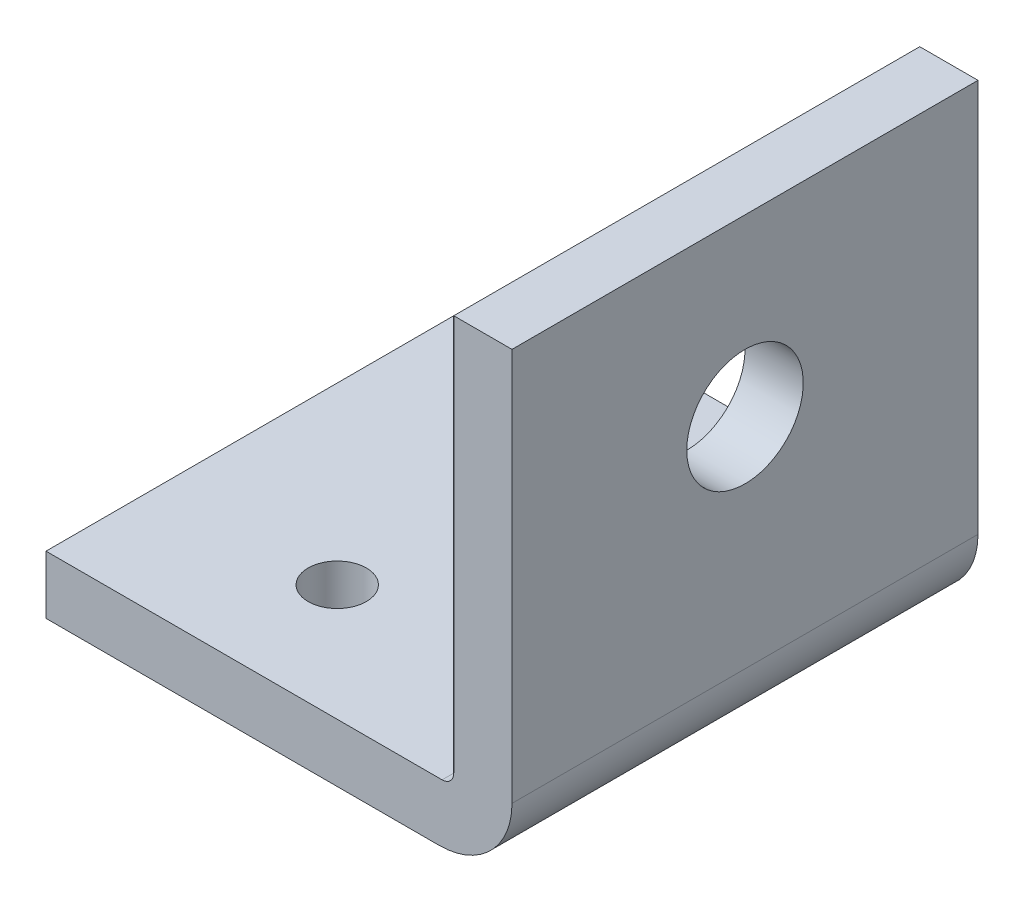
ISO-10303-21;
HEADER;
FILE_DESCRIPTION(('STEP AP214'),'2;1');
FILE_NAME('part.step','',(''),(''),'','','');
FILE_SCHEMA(('AUTOMOTIVE_DESIGN { 1 0 10303 214 1 1 1 1 }'));
ENDSEC;
DATA;
#1=APPLICATION_CONTEXT('core data for automotive mechanical design processes');
#2=APPLICATION_PROTOCOL_DEFINITION('international standard','automotive_design',2000,#1);
#3=PRODUCT_CONTEXT('',#1,'mechanical');
#4=PRODUCT('Part','Part','',(#3));
#5=PRODUCT_RELATED_PRODUCT_CATEGORY('part','',(#4));
#6=PRODUCT_DEFINITION_FORMATION('','',#4);
#7=PRODUCT_DEFINITION_CONTEXT('part definition',#1,'design');
#8=PRODUCT_DEFINITION('design','',#6,#7);
#9=PRODUCT_DEFINITION_SHAPE('','',#8);
#10=(LENGTH_UNIT() NAMED_UNIT(*) SI_UNIT(.MILLI.,.METRE.));
#11=(NAMED_UNIT(*) PLANE_ANGLE_UNIT() SI_UNIT($,.RADIAN.));
#12=(NAMED_UNIT(*) SI_UNIT($,.STERADIAN.) SOLID_ANGLE_UNIT());
#13=UNCERTAINTY_MEASURE_WITH_UNIT(LENGTH_MEASURE(1.E-05),#10,'distance_accuracy_value','');
#14=(GEOMETRIC_REPRESENTATION_CONTEXT(3) GLOBAL_UNCERTAINTY_ASSIGNED_CONTEXT((#13)) GLOBAL_UNIT_ASSIGNED_CONTEXT((#10,
#11,#12)) REPRESENTATION_CONTEXT('',''));
#15=CARTESIAN_POINT('',(0.,0.,0.));
#16=DIRECTION('',(0.,0.,1.));
#17=DIRECTION('',(1.,0.,0.));
#18=AXIS2_PLACEMENT_3D('',#15,#16,#17);
#19=CARTESIAN_POINT('',(33.75,0.,40.));
#20=DIRECTION('',(0.,1.,0.));
#21=DIRECTION('',(-1.,0.,0.));
#22=AXIS2_PLACEMENT_3D('',#19,#20,#21);
#23=PLANE('',#22);
#24=CARTESIAN_POINT('',(15.,0.,10.));
#25=DIRECTION('',(0.,1.,0.));
#26=DIRECTION('',(-1.,0.,0.));
#27=AXIS2_PLACEMENT_3D('',#24,#25,#26);
#28=CIRCLE('',#27,2.5);
#29=CARTESIAN_POINT('',(12.5,0.,10.));
#30=VERTEX_POINT('',#29);
#31=EDGE_CURVE('E156',#30,#30,#28,.T.);
#32=ORIENTED_EDGE('',*,*,#31,.T.);
#33=EDGE_LOOP('',(#32));
#34=FACE_BOUND('',#33,.T.);
#35=CARTESIAN_POINT('',(15.,0.,30.));
#36=DIRECTION('',(0.,1.,0.));
#37=DIRECTION('',(-1.,0.,0.));
#38=AXIS2_PLACEMENT_3D('',#35,#36,#37);
#39=CIRCLE('',#38,2.5);
#40=CARTESIAN_POINT('',(12.5,0.,30.));
#41=VERTEX_POINT('',#40);
#42=EDGE_CURVE('E165',#41,#41,#39,.T.);
#43=ORIENTED_EDGE('',*,*,#42,.T.);
#44=EDGE_LOOP('',(#43));
#45=FACE_BOUND('',#44,.T.);
#46=DIRECTION('',(1.,0.,0.));
#47=VECTOR('',#46,1.);
#48=CARTESIAN_POINT('',(33.75,0.,0.));
#49=LINE('',#48,#47);
#50=CARTESIAN_POINT('',(0.,0.,0.));
#51=VERTEX_POINT('',#50);
#52=CARTESIAN_POINT('',(33.75,0.,0.));
#53=VERTEX_POINT('',#52);
#54=EDGE_CURVE('E125',#51,#53,#49,.T.);
#55=ORIENTED_EDGE('',*,*,#54,.T.);
#56=DIRECTION('',(0.,0.,-1.));
#57=VECTOR('',#56,1.);
#58=CARTESIAN_POINT('',(33.75,0.,40.));
#59=LINE('',#58,#57);
#60=CARTESIAN_POINT('',(33.75,0.,40.));
#61=VERTEX_POINT('',#60);
#62=EDGE_CURVE('E106',#61,#53,#59,.T.);
#63=ORIENTED_EDGE('',*,*,#62,.F.);
#64=DIRECTION('',(1.,0.,0.));
#65=VECTOR('',#64,1.);
#66=CARTESIAN_POINT('',(33.75,0.,40.));
#67=LINE('',#66,#65);
#68=CARTESIAN_POINT('',(0.,0.,40.));
#69=VERTEX_POINT('',#68);
#70=EDGE_CURVE('E113',#69,#61,#67,.T.);
#71=ORIENTED_EDGE('',*,*,#70,.F.);
#72=DIRECTION('',(0.,0.,-1.));
#73=VECTOR('',#72,1.);
#74=CARTESIAN_POINT('',(0.,0.,40.));
#75=LINE('',#74,#73);
#76=EDGE_CURVE('E142',#69,#51,#75,.T.);
#77=ORIENTED_EDGE('',*,*,#76,.T.);
#78=EDGE_LOOP('',(#55,#63,#71,#77));
#79=FACE_BOUND('',#78,.T.);
#80=ADVANCED_FACE('F37',(#34,#45,#79),#23,.F.);
#81=CARTESIAN_POINT('',(33.75,6.25,40.));
#82=DIRECTION('',(0.,0.,-1.));
#83=DIRECTION('',(-1.,0.,0.));
#84=AXIS2_PLACEMENT_3D('',#81,#82,#83);
#85=CYLINDRICAL_SURFACE('',#84,6.25);
#86=CARTESIAN_POINT('',(33.75,6.25,0.));
#87=DIRECTION('',(0.,0.,1.));
#88=DIRECTION('',(-1.,0.,0.));
#89=AXIS2_PLACEMENT_3D('',#86,#87,#88);
#90=CIRCLE('',#89,6.25);
#91=CARTESIAN_POINT('',(40.,6.25000000000005,0.));
#92=VERTEX_POINT('',#91);
#93=EDGE_CURVE('E153',#53,#92,#90,.T.);
#94=ORIENTED_EDGE('',*,*,#93,.T.);
#95=DIRECTION('',(0.,0.,-1.));
#96=VECTOR('',#95,1.);
#97=CARTESIAN_POINT('',(40.,6.25000000000005,40.));
#98=LINE('',#97,#96);
#99=CARTESIAN_POINT('',(40.,6.25000000000005,40.));
#100=VERTEX_POINT('',#99);
#101=EDGE_CURVE('E109',#100,#92,#98,.T.);
#102=ORIENTED_EDGE('',*,*,#101,.F.);
#103=CARTESIAN_POINT('',(33.75,6.25,40.));
#104=DIRECTION('',(0.,0.,1.));
#105=DIRECTION('',(-1.,0.,0.));
#106=AXIS2_PLACEMENT_3D('',#103,#104,#105);
#107=CIRCLE('',#106,6.25);
#108=EDGE_CURVE('E102',#61,#100,#107,.T.);
#109=ORIENTED_EDGE('',*,*,#108,.F.);
#110=ORIENTED_EDGE('',*,*,#62,.T.);
#111=EDGE_LOOP('',(#94,#102,#109,#110));
#112=FACE_BOUND('',#111,.T.);
#113=ADVANCED_FACE('F104',(#112),#85,.T.);
#114=CARTESIAN_POINT('',(40.,40.,40.));
#115=DIRECTION('',(-1.,0.,0.));
#116=DIRECTION('',(0.,-1.,0.));
#117=AXIS2_PLACEMENT_3D('',#114,#115,#116);
#118=PLANE('',#117);
#119=CARTESIAN_POINT('',(40.,25.,20.));
#120=DIRECTION('',(-1.,0.,0.));
#121=DIRECTION('',(0.,0.,1.));
#122=AXIS2_PLACEMENT_3D('',#119,#120,#121);
#123=CIRCLE('',#122,5.);
#124=CARTESIAN_POINT('',(40.,25.,25.));
#125=VERTEX_POINT('',#124);
#126=EDGE_CURVE('E169',#125,#125,#123,.T.);
#127=ORIENTED_EDGE('',*,*,#126,.T.);
#128=EDGE_LOOP('',(#127));
#129=FACE_BOUND('',#128,.T.);
#130=DIRECTION('',(0.,1.,0.));
#131=VECTOR('',#130,1.);
#132=CARTESIAN_POINT('',(40.,40.,0.));
#133=LINE('',#132,#131);
#134=CARTESIAN_POINT('',(40.,40.,0.));
#135=VERTEX_POINT('',#134);
#136=EDGE_CURVE('E151',#92,#135,#133,.T.);
#137=ORIENTED_EDGE('',*,*,#136,.T.);
#138=DIRECTION('',(0.,0.,-1.));
#139=VECTOR('',#138,1.);
#140=CARTESIAN_POINT('',(40.,40.,40.));
#141=LINE('',#140,#139);
#142=CARTESIAN_POINT('',(40.,40.,40.));
#143=VERTEX_POINT('',#142);
#144=EDGE_CURVE('E130',#143,#135,#141,.T.);
#145=ORIENTED_EDGE('',*,*,#144,.F.);
#146=DIRECTION('',(0.,1.,0.));
#147=VECTOR('',#146,1.);
#148=CARTESIAN_POINT('',(40.,40.,40.));
#149=LINE('',#148,#147);
#150=EDGE_CURVE('E112',#100,#143,#149,.T.);
#151=ORIENTED_EDGE('',*,*,#150,.F.);
#152=ORIENTED_EDGE('',*,*,#101,.T.);
#153=EDGE_LOOP('',(#137,#145,#151,#152));
#154=FACE_BOUND('',#153,.T.);
#155=ADVANCED_FACE('F183',(#129,#154),#118,.F.);
#156=CARTESIAN_POINT('',(35.,40.,40.));
#157=DIRECTION('',(0.,-1.,0.));
#158=DIRECTION('',(0.,0.,-1.));
#159=AXIS2_PLACEMENT_3D('',#156,#157,#158);
#160=PLANE('',#159);
#161=DIRECTION('',(-1.,0.,0.));
#162=VECTOR('',#161,1.);
#163=CARTESIAN_POINT('',(35.,40.,0.));
#164=LINE('',#163,#162);
#165=CARTESIAN_POINT('',(35.,40.,0.));
#166=VERTEX_POINT('',#165);
#167=EDGE_CURVE('E149',#135,#166,#164,.T.);
#168=ORIENTED_EDGE('',*,*,#167,.T.);
#169=DIRECTION('',(0.,0.,-1.));
#170=VECTOR('',#169,1.);
#171=CARTESIAN_POINT('',(35.,40.,40.));
#172=LINE('',#171,#170);
#173=CARTESIAN_POINT('',(35.,40.,40.));
#174=VERTEX_POINT('',#173);
#175=EDGE_CURVE('E136',#174,#166,#172,.T.);
#176=ORIENTED_EDGE('',*,*,#175,.F.);
#177=DIRECTION('',(-1.,0.,0.));
#178=VECTOR('',#177,1.);
#179=CARTESIAN_POINT('',(35.,40.,40.));
#180=LINE('',#179,#178);
#181=EDGE_CURVE('E162',#143,#174,#180,.T.);
#182=ORIENTED_EDGE('',*,*,#181,.F.);
#183=ORIENTED_EDGE('',*,*,#144,.T.);
#184=EDGE_LOOP('',(#168,#176,#182,#183));
#185=FACE_BOUND('',#184,.T.);
#186=ADVANCED_FACE('F196',(#185),#160,.F.);
#187=CARTESIAN_POINT('',(35.,4.99999999999999,40.));
#188=DIRECTION('',(1.,0.,0.));
#189=DIRECTION('',(0.,0.,-1.));
#190=AXIS2_PLACEMENT_3D('',#187,#188,#189);
#191=PLANE('',#190);
#192=CARTESIAN_POINT('',(35.,25.,20.));
#193=DIRECTION('',(-1.,0.,0.));
#194=DIRECTION('',(0.,0.,1.));
#195=AXIS2_PLACEMENT_3D('',#192,#193,#194);
#196=CIRCLE('',#195,5.);
#197=CARTESIAN_POINT('',(35.,25.,25.));
#198=VERTEX_POINT('',#197);
#199=EDGE_CURVE('E177',#198,#198,#196,.T.);
#200=ORIENTED_EDGE('',*,*,#199,.F.);
#201=EDGE_LOOP('',(#200));
#202=FACE_BOUND('',#201,.T.);
#203=DIRECTION('',(0.,-1.,0.));
#204=VECTOR('',#203,1.);
#205=CARTESIAN_POINT('',(35.,4.99999999999999,0.));
#206=LINE('',#205,#204);
#207=CARTESIAN_POINT('',(35.,5.99999999999999,0.));
#208=VERTEX_POINT('',#207);
#209=EDGE_CURVE('E147',#166,#208,#206,.T.);
#210=ORIENTED_EDGE('',*,*,#209,.T.);
#211=DIRECTION('',(0.,0.,-1.));
#212=VECTOR('',#211,1.);
#213=CARTESIAN_POINT('',(35.,5.99999999999999,40.));
#214=LINE('',#213,#212);
#215=CARTESIAN_POINT('',(35.,5.99999999999999,40.));
#216=VERTEX_POINT('',#215);
#217=EDGE_CURVE('E52',#208,#216,#214,.F.);
#218=ORIENTED_EDGE('',*,*,#217,.T.);
#219=DIRECTION('',(0.,-1.,0.));
#220=VECTOR('',#219,1.);
#221=CARTESIAN_POINT('',(35.,4.99999999999999,40.));
#222=LINE('',#221,#220);
#223=EDGE_CURVE('E160',#174,#216,#222,.T.);
#224=ORIENTED_EDGE('',*,*,#223,.F.);
#225=ORIENTED_EDGE('',*,*,#175,.T.);
#226=EDGE_LOOP('',(#210,#218,#224,#225));
#227=FACE_BOUND('',#226,.T.);
#228=ADVANCED_FACE('F193',(#202,#227),#191,.F.);
#229=CARTESIAN_POINT('',(0.,5.,40.));
#230=DIRECTION('',(0.,-1.,0.));
#231=DIRECTION('',(1.,0.,0.));
#232=AXIS2_PLACEMENT_3D('',#229,#230,#231);
#233=PLANE('',#232);
#234=CARTESIAN_POINT('',(15.,5.,10.));
#235=DIRECTION('',(0.,1.,0.));
#236=DIRECTION('',(-1.,0.,0.));
#237=AXIS2_PLACEMENT_3D('',#234,#235,#236);
#238=CIRCLE('',#237,2.5);
#239=CARTESIAN_POINT('',(12.5,5.,10.));
#240=VERTEX_POINT('',#239);
#241=EDGE_CURVE('E172',#240,#240,#238,.T.);
#242=ORIENTED_EDGE('',*,*,#241,.F.);
#243=EDGE_LOOP('',(#242));
#244=FACE_BOUND('',#243,.T.);
#245=CARTESIAN_POINT('',(15.,5.,30.));
#246=DIRECTION('',(0.,1.,0.));
#247=DIRECTION('',(-1.,0.,0.));
#248=AXIS2_PLACEMENT_3D('',#245,#246,#247);
#249=CIRCLE('',#248,2.5);
#250=CARTESIAN_POINT('',(12.5,5.,30.));
#251=VERTEX_POINT('',#250);
#252=EDGE_CURVE('E168',#251,#251,#249,.T.);
#253=ORIENTED_EDGE('',*,*,#252,.F.);
#254=EDGE_LOOP('',(#253));
#255=FACE_BOUND('',#254,.T.);
#256=DIRECTION('',(-1.,0.,0.));
#257=VECTOR('',#256,1.);
#258=CARTESIAN_POINT('',(0.,5.,40.));
#259=LINE('',#258,#257);
#260=CARTESIAN_POINT('',(34.,4.99999999999999,40.));
#261=VERTEX_POINT('',#260);
#262=CARTESIAN_POINT('',(0.,5.,40.));
#263=VERTEX_POINT('',#262);
#264=EDGE_CURVE('E158',#261,#263,#259,.T.);
#265=ORIENTED_EDGE('',*,*,#264,.F.);
#266=DIRECTION('',(0.,0.,-1.));
#267=VECTOR('',#266,1.);
#268=CARTESIAN_POINT('',(34.,4.99999999999999,0.));
#269=LINE('',#268,#267);
#270=CARTESIAN_POINT('',(34.,4.99999999999999,0.));
#271=VERTEX_POINT('',#270);
#272=EDGE_CURVE('E126',#261,#271,#269,.T.);
#273=ORIENTED_EDGE('',*,*,#272,.T.);
#274=DIRECTION('',(-1.,0.,0.));
#275=VECTOR('',#274,1.);
#276=CARTESIAN_POINT('',(0.,5.,0.));
#277=LINE('',#276,#275);
#278=CARTESIAN_POINT('',(0.,5.,0.));
#279=VERTEX_POINT('',#278);
#280=EDGE_CURVE('E145',#271,#279,#277,.T.);
#281=ORIENTED_EDGE('',*,*,#280,.T.);
#282=DIRECTION('',(0.,0.,-1.));
#283=VECTOR('',#282,1.);
#284=CARTESIAN_POINT('',(0.,5.,40.));
#285=LINE('',#284,#283);
#286=EDGE_CURVE('E139',#263,#279,#285,.T.);
#287=ORIENTED_EDGE('',*,*,#286,.F.);
#288=EDGE_LOOP('',(#265,#273,#281,#287));
#289=FACE_BOUND('',#288,.T.);
#290=ADVANCED_FACE('F195',(#244,#255,#289),#233,.F.);
#291=CARTESIAN_POINT('',(0.,0.,40.));
#292=DIRECTION('',(1.,0.,0.));
#293=DIRECTION('',(0.,0.,-1.));
#294=AXIS2_PLACEMENT_3D('',#291,#292,#293);
#295=PLANE('',#294);
#296=DIRECTION('',(0.,-1.,0.));
#297=VECTOR('',#296,1.);
#298=CARTESIAN_POINT('',(0.,0.,0.));
#299=LINE('',#298,#297);
#300=EDGE_CURVE('E122',#279,#51,#299,.T.);
#301=ORIENTED_EDGE('',*,*,#300,.T.);
#302=ORIENTED_EDGE('',*,*,#76,.F.);
#303=DIRECTION('',(0.,-1.,0.));
#304=VECTOR('',#303,1.);
#305=CARTESIAN_POINT('',(0.,0.,40.));
#306=LINE('',#305,#304);
#307=EDGE_CURVE('E118',#263,#69,#306,.T.);
#308=ORIENTED_EDGE('',*,*,#307,.F.);
#309=ORIENTED_EDGE('',*,*,#286,.T.);
#310=EDGE_LOOP('',(#301,#302,#308,#309));
#311=FACE_BOUND('',#310,.T.);
#312=ADVANCED_FACE('F208',(#311),#295,.F.);
#313=CARTESIAN_POINT('',(33.75,6.25,40.));
#314=DIRECTION('',(0.,0.,-1.));
#315=DIRECTION('',(-1.,0.,0.));
#316=AXIS2_PLACEMENT_3D('',#313,#314,#315);
#317=PLANE('',#316);
#318=ORIENTED_EDGE('',*,*,#70,.T.);
#319=ORIENTED_EDGE('',*,*,#108,.T.);
#320=ORIENTED_EDGE('',*,*,#150,.T.);
#321=ORIENTED_EDGE('',*,*,#181,.T.);
#322=ORIENTED_EDGE('',*,*,#223,.T.);
#323=CARTESIAN_POINT('',(34.,5.99999999999999,40.));
#324=DIRECTION('',(0.,0.,-1.));
#325=DIRECTION('',(-1.,0.,0.));
#326=AXIS2_PLACEMENT_3D('',#323,#324,#325);
#327=CIRCLE('',#326,1.);
#328=EDGE_CURVE('E11',#216,#261,#327,.T.);
#329=ORIENTED_EDGE('',*,*,#328,.T.);
#330=ORIENTED_EDGE('',*,*,#264,.T.);
#331=ORIENTED_EDGE('',*,*,#307,.T.);
#332=EDGE_LOOP('',(#318,#319,#320,#321,#322,#329,#330,#331));
#333=FACE_BOUND('',#332,.T.);
#334=ADVANCED_FACE('F116',(#333),#317,.F.);
#335=CARTESIAN_POINT('',(33.75,6.25,0.));
#336=DIRECTION('',(0.,0.,-1.));
#337=DIRECTION('',(-1.,0.,0.));
#338=AXIS2_PLACEMENT_3D('',#335,#336,#337);
#339=PLANE('',#338);
#340=ORIENTED_EDGE('',*,*,#54,.F.);
#341=ORIENTED_EDGE('',*,*,#300,.F.);
#342=ORIENTED_EDGE('',*,*,#280,.F.);
#343=CARTESIAN_POINT('',(34.,5.99999999999999,0.));
#344=DIRECTION('',(0.,0.,-1.));
#345=DIRECTION('',(-1.,0.,0.));
#346=AXIS2_PLACEMENT_3D('',#343,#344,#345);
#347=CIRCLE('',#346,1.);
#348=EDGE_CURVE('E45',#271,#208,#347,.F.);
#349=ORIENTED_EDGE('',*,*,#348,.T.);
#350=ORIENTED_EDGE('',*,*,#209,.F.);
#351=ORIENTED_EDGE('',*,*,#167,.F.);
#352=ORIENTED_EDGE('',*,*,#136,.F.);
#353=ORIENTED_EDGE('',*,*,#93,.F.);
#354=EDGE_LOOP('',(#340,#341,#342,#349,#350,#351,#352,#353));
#355=FACE_BOUND('',#354,.T.);
#356=ADVANCED_FACE('F209',(#355),#339,.T.);
#357=CARTESIAN_POINT('',(15.,0.,30.));
#358=DIRECTION('',(0.,1.,0.));
#359=DIRECTION('',(-1.,0.,0.));
#360=AXIS2_PLACEMENT_3D('',#357,#358,#359);
#361=CYLINDRICAL_SURFACE('',#360,2.5);
#362=ORIENTED_EDGE('',*,*,#42,.F.);
#363=EDGE_LOOP('',(#362));
#364=FACE_BOUND('',#363,.T.);
#365=ORIENTED_EDGE('',*,*,#252,.T.);
#366=EDGE_LOOP('',(#365));
#367=FACE_BOUND('',#366,.T.);
#368=ADVANCED_FACE('F230',(#364,#367),#361,.F.);
#369=CARTESIAN_POINT('',(15.,0.,10.));
#370=DIRECTION('',(0.,1.,0.));
#371=DIRECTION('',(-1.,0.,0.));
#372=AXIS2_PLACEMENT_3D('',#369,#370,#371);
#373=CYLINDRICAL_SURFACE('',#372,2.5);
#374=ORIENTED_EDGE('',*,*,#31,.F.);
#375=EDGE_LOOP('',(#374));
#376=FACE_BOUND('',#375,.T.);
#377=ORIENTED_EDGE('',*,*,#241,.T.);
#378=EDGE_LOOP('',(#377));
#379=FACE_BOUND('',#378,.T.);
#380=ADVANCED_FACE('F189',(#376,#379),#373,.F.);
#381=CARTESIAN_POINT('',(40.,25.,20.));
#382=DIRECTION('',(-1.,0.,0.));
#383=DIRECTION('',(0.,0.,1.));
#384=AXIS2_PLACEMENT_3D('',#381,#382,#383);
#385=CYLINDRICAL_SURFACE('',#384,5.);
#386=ORIENTED_EDGE('',*,*,#126,.F.);
#387=EDGE_LOOP('',(#386));
#388=FACE_BOUND('',#387,.T.);
#389=ORIENTED_EDGE('',*,*,#199,.T.);
#390=EDGE_LOOP('',(#389));
#391=FACE_BOUND('',#390,.T.);
#392=ADVANCED_FACE('F186',(#388,#391),#385,.F.);
#393=CARTESIAN_POINT('',(34.,5.99999999999999,40.));
#394=DIRECTION('',(0.,0.,1.));
#395=DIRECTION('',(1.,0.,0.));
#396=AXIS2_PLACEMENT_3D('',#393,#394,#395);
#397=CYLINDRICAL_SURFACE('',#396,1.);
#398=ORIENTED_EDGE('',*,*,#328,.F.);
#399=ORIENTED_EDGE('',*,*,#217,.F.);
#400=ORIENTED_EDGE('',*,*,#348,.F.);
#401=ORIENTED_EDGE('',*,*,#272,.F.);
#402=EDGE_LOOP('',(#398,#399,#400,#401));
#403=FACE_BOUND('',#402,.T.);
#404=ADVANCED_FACE('F39',(#403),#397,.F.);
#405=CLOSED_SHELL('',(#80,#113,#155,#186,#228,#290,#312,#334,#356,#368,#380,#392,#404));
#406=MANIFOLD_SOLID_BREP('B2',#405);
#407=ADVANCED_BREP_SHAPE_REPRESENTATION('',(#18,#406),#14);
#408=SHAPE_DEFINITION_REPRESENTATION(#9,#407);
ENDSEC;
END-ISO-10303-21;
